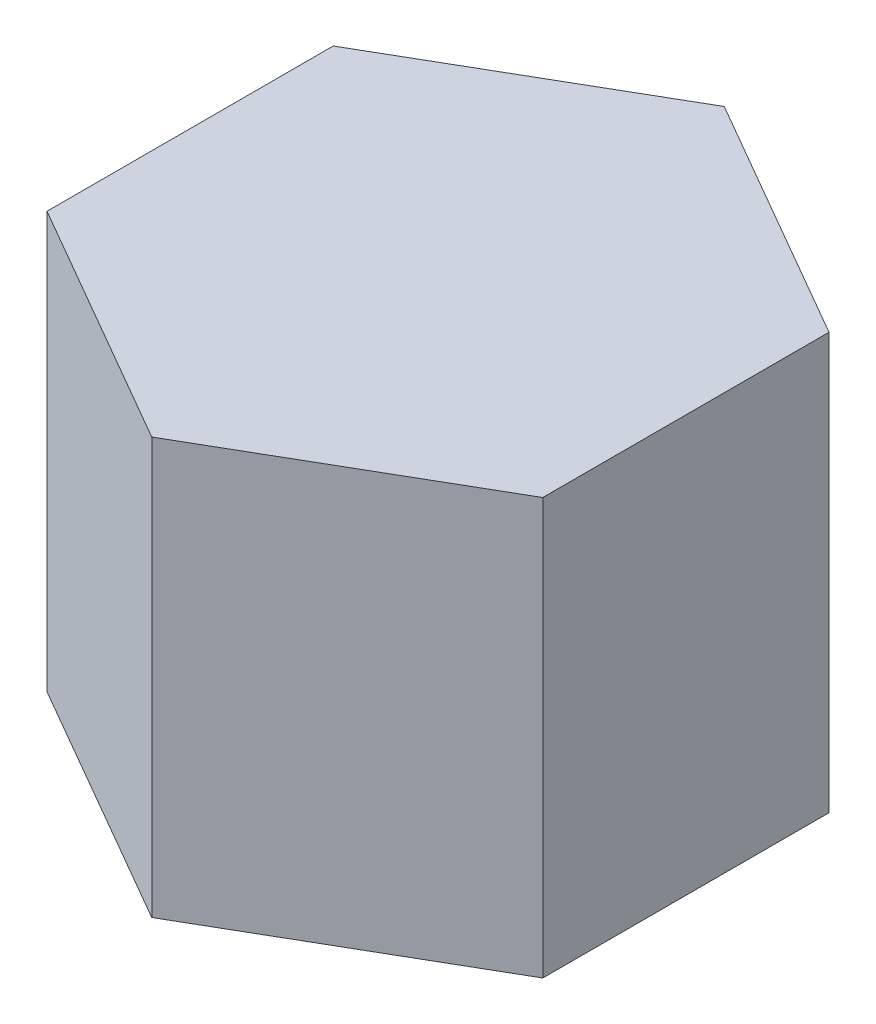
ISO-10303-21;
HEADER;
FILE_DESCRIPTION(('STEP AP214'),'2;1');
FILE_NAME('part.step','',(''),(''),'','','');
FILE_SCHEMA(('AUTOMOTIVE_DESIGN { 1 0 10303 214 1 1 1 1 }'));
ENDSEC;
DATA;
#1=APPLICATION_CONTEXT('core data for automotive mechanical design processes');
#2=APPLICATION_PROTOCOL_DEFINITION('international standard','automotive_design',2000,#1);
#3=PRODUCT_CONTEXT('',#1,'mechanical');
#4=PRODUCT('Part','Part','',(#3));
#5=PRODUCT_RELATED_PRODUCT_CATEGORY('part','',(#4));
#6=PRODUCT_DEFINITION_FORMATION('','',#4);
#7=PRODUCT_DEFINITION_CONTEXT('part definition',#1,'design');
#8=PRODUCT_DEFINITION('design','',#6,#7);
#9=PRODUCT_DEFINITION_SHAPE('','',#8);
#10=(LENGTH_UNIT() NAMED_UNIT(*) SI_UNIT(.MILLI.,.METRE.));
#11=(NAMED_UNIT(*) PLANE_ANGLE_UNIT() SI_UNIT($,.RADIAN.));
#12=(NAMED_UNIT(*) SI_UNIT($,.STERADIAN.) SOLID_ANGLE_UNIT());
#13=UNCERTAINTY_MEASURE_WITH_UNIT(LENGTH_MEASURE(1.E-05),#10,'distance_accuracy_value','');
#14=(GEOMETRIC_REPRESENTATION_CONTEXT(3) GLOBAL_UNCERTAINTY_ASSIGNED_CONTEXT((#13)) GLOBAL_UNIT_ASSIGNED_CONTEXT((#10,
#11,#12)) REPRESENTATION_CONTEXT('',''));
#15=CARTESIAN_POINT('',(0.,0.,0.));
#16=DIRECTION('',(0.,0.,1.));
#17=DIRECTION('',(1.,0.,0.));
#18=AXIS2_PLACEMENT_3D('',#15,#16,#17);
#19=CARTESIAN_POINT('',(206.839551417382,-147.556598747966,287.351844201572));
#20=DIRECTION('',(-0.499999999999943,0.,-0.866025403784471));
#21=DIRECTION('',(-0.866025403784471,0.,0.499999999999943));
#22=AXIS2_PLACEMENT_3D('',#19,#20,#21);
#23=PLANE('',#22);
#24=CARTESIAN_POINT('',(207.142660308706,-147.047793579175,287.176844201572));
#25=DIRECTION('',(-0.866025403784471,0.,0.499999999999943));
#26=VECTOR('',#25,1.);
#27=LINE('',#24,#26);
#28=CARTESIAN_POINT('',(207.142660308706,-147.047793579175,287.176844201572));
#29=VERTEX_POINT('',#28);
#30=CARTESIAN_POINT('',(206.839551417382,-147.047793579175,287.351844201572));
#31=VERTEX_POINT('',#30);
#32=EDGE_CURVE('E170',#29,#31,#27,.T.);
#33=ORIENTED_EDGE('',*,*,#32,.T.);
#34=CARTESIAN_POINT('',(206.839551417382,-147.556598747966,287.351844201572));
#35=DIRECTION('',(0.,1.,0.));
#36=VECTOR('',#35,1.);
#37=LINE('',#34,#36);
#38=CARTESIAN_POINT('',(206.839551417382,-147.556598747966,287.351844201572));
#39=VERTEX_POINT('',#38);
#40=EDGE_CURVE('E35',#39,#31,#37,.T.);
#41=ORIENTED_EDGE('',*,*,#40,.F.);
#42=CARTESIAN_POINT('',(207.142660308706,-147.556598747966,287.176844201572));
#43=DIRECTION('',(-0.866025403784471,0.,0.499999999999943));
#44=VECTOR('',#43,1.);
#45=LINE('',#42,#44);
#46=CARTESIAN_POINT('',(207.142660308706,-147.556598747966,287.176844201572));
#47=VERTEX_POINT('',#46);
#48=EDGE_CURVE('E159',#47,#39,#45,.T.);
#49=ORIENTED_EDGE('',*,*,#48,.F.);
#50=CARTESIAN_POINT('',(207.142660308706,-147.556598747966,287.176844201572));
#51=DIRECTION('',(0.,1.,0.));
#52=VECTOR('',#51,1.);
#53=LINE('',#50,#52);
#54=EDGE_CURVE('E10',#47,#29,#53,.T.);
#55=ORIENTED_EDGE('',*,*,#54,.T.);
#56=EDGE_LOOP('',(#33,#41,#49,#55));
#57=FACE_BOUND('',#56,.T.);
#58=ADVANCED_FACE('F16',(#57),#23,.F.);
#59=CARTESIAN_POINT('',(207.142660308706,-147.556598747966,291.594471220494));
#60=DIRECTION('',(-1.,0.,0.));
#61=DIRECTION('',(0.,-1.,0.));
#62=AXIS2_PLACEMENT_3D('',#59,#60,#61);
#63=PLANE('',#62);
#64=CARTESIAN_POINT('',(207.142660308706,-147.047793579175,286.826844201572));
#65=DIRECTION('',(0.,0.,1.));
#66=VECTOR('',#65,1.);
#67=LINE('',#64,#66);
#68=CARTESIAN_POINT('',(207.142660308706,-147.047793579175,286.826844201572));
#69=VERTEX_POINT('',#68);
#70=EDGE_CURVE('E167',#69,#29,#67,.T.);
#71=ORIENTED_EDGE('',*,*,#70,.T.);
#72=ORIENTED_EDGE('',*,*,#54,.F.);
#73=CARTESIAN_POINT('',(207.142660308706,-147.556598747966,286.826844201572));
#74=DIRECTION('',(0.,0.,1.));
#75=VECTOR('',#74,1.);
#76=LINE('',#73,#75);
#77=CARTESIAN_POINT('',(207.142660308706,-147.556598747966,286.826844201572));
#78=VERTEX_POINT('',#77);
#79=EDGE_CURVE('E156',#78,#47,#76,.T.);
#80=ORIENTED_EDGE('',*,*,#79,.F.);
#81=CARTESIAN_POINT('',(207.142660308706,-147.556598747966,286.826844201572));
#82=DIRECTION('',(0.,1.,0.));
#83=VECTOR('',#82,1.);
#84=LINE('',#81,#83);
#85=EDGE_CURVE('E27',#78,#69,#84,.T.);
#86=ORIENTED_EDGE('',*,*,#85,.T.);
#87=EDGE_LOOP('',(#71,#72,#80,#86));
#88=FACE_BOUND('',#87,.T.);
#89=ADVANCED_FACE('F189',(#88),#63,.F.);
#90=CARTESIAN_POINT('',(207.142660308706,-147.556598747966,286.826844201572));
#91=DIRECTION('',(-0.499999999999943,0.,0.866025403784471));
#92=DIRECTION('',(0.866025403784471,0.,0.499999999999943));
#93=AXIS2_PLACEMENT_3D('',#90,#91,#92);
#94=PLANE('',#93);
#95=CARTESIAN_POINT('',(206.839551417382,-147.047793579175,286.651844201572));
#96=DIRECTION('',(0.866025403784471,0.,0.499999999999943));
#97=VECTOR('',#96,1.);
#98=LINE('',#95,#97);
#99=CARTESIAN_POINT('',(206.839551417382,-147.047793579175,286.651844201572));
#100=VERTEX_POINT('',#99);
#101=EDGE_CURVE('E163',#100,#69,#98,.T.);
#102=ORIENTED_EDGE('',*,*,#101,.T.);
#103=ORIENTED_EDGE('',*,*,#85,.F.);
#104=CARTESIAN_POINT('',(206.839551417382,-147.556598747966,286.651844201572));
#105=DIRECTION('',(0.866025403784471,0.,0.499999999999943));
#106=VECTOR('',#105,1.);
#107=LINE('',#104,#106);
#108=CARTESIAN_POINT('',(206.839551417382,-147.556598747966,286.651844201572));
#109=VERTEX_POINT('',#108);
#110=EDGE_CURVE('E106',#109,#78,#107,.T.);
#111=ORIENTED_EDGE('',*,*,#110,.F.);
#112=CARTESIAN_POINT('',(206.839551417382,-147.556598747966,286.651844201572));
#113=DIRECTION('',(0.,1.,0.));
#114=VECTOR('',#113,1.);
#115=LINE('',#112,#114);
#116=EDGE_CURVE('E94',#109,#100,#115,.T.);
#117=ORIENTED_EDGE('',*,*,#116,.T.);
#118=EDGE_LOOP('',(#102,#103,#111,#117));
#119=FACE_BOUND('',#118,.T.);
#120=ADVANCED_FACE('F198',(#119),#94,.F.);
#121=CARTESIAN_POINT('',(206.839551417382,-147.556598747966,286.651844201572));
#122=DIRECTION('',(0.499999999999978,0.,0.866025403784452));
#123=DIRECTION('',(0.866025403784452,0.,-0.499999999999978));
#124=AXIS2_PLACEMENT_3D('',#121,#122,#123);
#125=PLANE('',#124);
#126=CARTESIAN_POINT('',(206.536442526057,-147.047793579175,286.826844201572));
#127=DIRECTION('',(0.866025403784452,0.,-0.499999999999978));
#128=VECTOR('',#127,1.);
#129=LINE('',#126,#128);
#130=CARTESIAN_POINT('',(206.536442526057,-147.047793579175,286.826844201572));
#131=VERTEX_POINT('',#130);
#132=EDGE_CURVE('E162',#131,#100,#129,.T.);
#133=ORIENTED_EDGE('',*,*,#132,.T.);
#134=ORIENTED_EDGE('',*,*,#116,.F.);
#135=CARTESIAN_POINT('',(206.536442526057,-147.556598747966,286.826844201572));
#136=DIRECTION('',(0.866025403784452,0.,-0.499999999999978));
#137=VECTOR('',#136,1.);
#138=LINE('',#135,#137);
#139=CARTESIAN_POINT('',(206.536442526057,-147.556598747966,286.826844201572));
#140=VERTEX_POINT('',#139);
#141=EDGE_CURVE('E98',#140,#109,#138,.T.);
#142=ORIENTED_EDGE('',*,*,#141,.F.);
#143=CARTESIAN_POINT('',(206.536442526057,-147.556598747966,286.826844201572));
#144=DIRECTION('',(0.,1.,0.));
#145=VECTOR('',#144,1.);
#146=LINE('',#143,#145);
#147=EDGE_CURVE('E79',#140,#131,#146,.T.);
#148=ORIENTED_EDGE('',*,*,#147,.T.);
#149=EDGE_LOOP('',(#133,#134,#142,#148));
#150=FACE_BOUND('',#149,.T.);
#151=ADVANCED_FACE('F100',(#150),#125,.F.);
#152=CARTESIAN_POINT('',(206.536442526057,-147.556598747966,291.594471220494));
#153=DIRECTION('',(1.,0.,0.));
#154=DIRECTION('',(0.,1.,0.));
#155=AXIS2_PLACEMENT_3D('',#152,#153,#154);
#156=PLANE('',#155);
#157=CARTESIAN_POINT('',(206.536442526057,-147.047793579175,287.176844201572));
#158=DIRECTION('',(0.,0.,-1.));
#159=VECTOR('',#158,1.);
#160=LINE('',#157,#159);
#161=CARTESIAN_POINT('',(206.536442526057,-147.047793579175,287.176844201572));
#162=VERTEX_POINT('',#161);
#163=EDGE_CURVE('E88',#162,#131,#160,.T.);
#164=ORIENTED_EDGE('',*,*,#163,.T.);
#165=ORIENTED_EDGE('',*,*,#147,.F.);
#166=CARTESIAN_POINT('',(206.536442526057,-147.556598747966,287.176844201572));
#167=DIRECTION('',(0.,0.,-1.));
#168=VECTOR('',#167,1.);
#169=LINE('',#166,#168);
#170=CARTESIAN_POINT('',(206.536442526057,-147.556598747966,287.176844201572));
#171=VERTEX_POINT('',#170);
#172=EDGE_CURVE('E84',#171,#140,#169,.T.);
#173=ORIENTED_EDGE('',*,*,#172,.F.);
#174=CARTESIAN_POINT('',(206.536442526057,-147.556598747966,287.176844201572));
#175=DIRECTION('',(0.,1.,0.));
#176=VECTOR('',#175,1.);
#177=LINE('',#174,#176);
#178=EDGE_CURVE('E58',#171,#162,#177,.T.);
#179=ORIENTED_EDGE('',*,*,#178,.T.);
#180=EDGE_LOOP('',(#164,#165,#173,#179));
#181=FACE_BOUND('',#180,.T.);
#182=ADVANCED_FACE('F82',(#181),#156,.F.);
#183=CARTESIAN_POINT('',(206.536442526057,-147.556598747966,287.176844201572));
#184=DIRECTION('',(0.499999999999978,0.,-0.866025403784452));
#185=DIRECTION('',(-0.866025403784452,0.,-0.499999999999978));
#186=AXIS2_PLACEMENT_3D('',#183,#184,#185);
#187=PLANE('',#186);
#188=CARTESIAN_POINT('',(206.839551417382,-147.047793579175,287.351844201572));
#189=DIRECTION('',(-0.866025403784452,0.,-0.499999999999978));
#190=VECTOR('',#189,1.);
#191=LINE('',#188,#190);
#192=EDGE_CURVE('E160',#31,#162,#191,.T.);
#193=ORIENTED_EDGE('',*,*,#192,.T.);
#194=ORIENTED_EDGE('',*,*,#178,.F.);
#195=CARTESIAN_POINT('',(206.839551417382,-147.556598747966,287.351844201572));
#196=DIRECTION('',(-0.866025403784452,0.,-0.499999999999978));
#197=VECTOR('',#196,1.);
#198=LINE('',#195,#197);
#199=EDGE_CURVE('E112',#39,#171,#198,.T.);
#200=ORIENTED_EDGE('',*,*,#199,.F.);
#201=ORIENTED_EDGE('',*,*,#40,.T.);
#202=EDGE_LOOP('',(#193,#194,#200,#201));
#203=FACE_BOUND('',#202,.T.);
#204=ADVANCED_FACE('F131',(#203),#187,.F.);
#205=CARTESIAN_POINT('',(206.491105863044,-147.556598747966,291.594471220494));
#206=DIRECTION('',(0.,1.,0.));
#207=DIRECTION('',(-1.,0.,0.));
#208=AXIS2_PLACEMENT_3D('',#205,#206,#207);
#209=PLANE('',#208);
#210=ORIENTED_EDGE('',*,*,#48,.T.);
#211=ORIENTED_EDGE('',*,*,#199,.T.);
#212=ORIENTED_EDGE('',*,*,#172,.T.);
#213=ORIENTED_EDGE('',*,*,#141,.T.);
#214=ORIENTED_EDGE('',*,*,#110,.T.);
#215=ORIENTED_EDGE('',*,*,#79,.T.);
#216=EDGE_LOOP('',(#210,#211,#212,#213,#214,#215));
#217=FACE_BOUND('',#216,.T.);
#218=ADVANCED_FACE('F111',(#217),#209,.F.);
#219=CARTESIAN_POINT('',(206.491105863044,-147.047793579175,291.594471220494));
#220=DIRECTION('',(0.,1.,0.));
#221=DIRECTION('',(-1.,0.,0.));
#222=AXIS2_PLACEMENT_3D('',#219,#220,#221);
#223=PLANE('',#222);
#224=ORIENTED_EDGE('',*,*,#32,.F.);
#225=ORIENTED_EDGE('',*,*,#70,.F.);
#226=ORIENTED_EDGE('',*,*,#101,.F.);
#227=ORIENTED_EDGE('',*,*,#132,.F.);
#228=ORIENTED_EDGE('',*,*,#163,.F.);
#229=ORIENTED_EDGE('',*,*,#192,.F.);
#230=EDGE_LOOP('',(#224,#225,#226,#227,#228,#229));
#231=FACE_BOUND('',#230,.T.);
#232=ADVANCED_FACE('F130',(#231),#223,.T.);
#233=CLOSED_SHELL('',(#58,#89,#120,#151,#182,#204,#218,#232));
#234=MANIFOLD_SOLID_BREP('B1',#233);
#235=ADVANCED_BREP_SHAPE_REPRESENTATION('',(#18,#234),#14);
#236=SHAPE_DEFINITION_REPRESENTATION(#9,#235);
ENDSEC;
END-ISO-10303-21;
